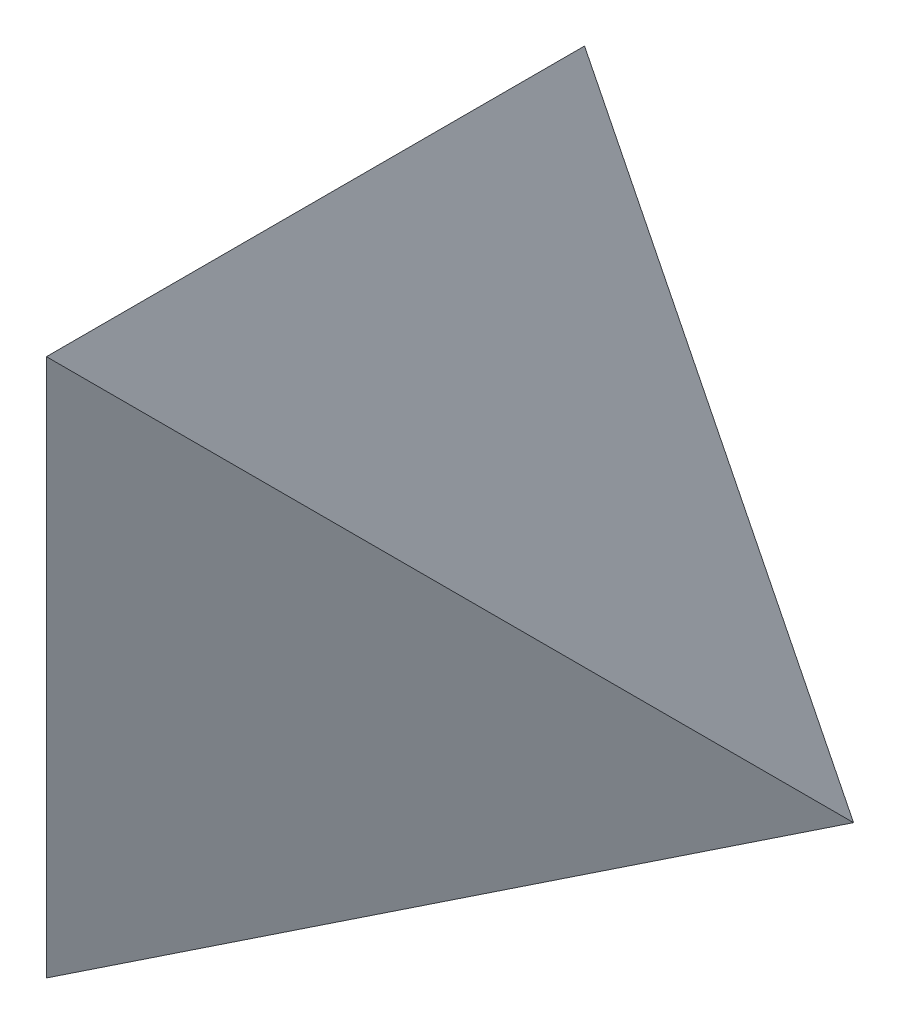
ISO-10303-21;
HEADER;
FILE_DESCRIPTION(('STEP AP214'),'2;1');
FILE_NAME('part.step','',(''),(''),'','','');
FILE_SCHEMA(('AUTOMOTIVE_DESIGN { 1 0 10303 214 1 1 1 1 }'));
ENDSEC;
DATA;
#1=APPLICATION_CONTEXT('core data for automotive mechanical design processes');
#2=APPLICATION_PROTOCOL_DEFINITION('international standard','automotive_design',2000,#1);
#3=PRODUCT_CONTEXT('',#1,'mechanical');
#4=PRODUCT('Part','Part','',(#3));
#5=PRODUCT_RELATED_PRODUCT_CATEGORY('part','',(#4));
#6=PRODUCT_DEFINITION_FORMATION('','',#4);
#7=PRODUCT_DEFINITION_CONTEXT('part definition',#1,'design');
#8=PRODUCT_DEFINITION('design','',#6,#7);
#9=PRODUCT_DEFINITION_SHAPE('','',#8);
#10=(LENGTH_UNIT() NAMED_UNIT(*) SI_UNIT(.MILLI.,.METRE.));
#11=(NAMED_UNIT(*) PLANE_ANGLE_UNIT() SI_UNIT($,.RADIAN.));
#12=(NAMED_UNIT(*) SI_UNIT($,.STERADIAN.) SOLID_ANGLE_UNIT());
#13=UNCERTAINTY_MEASURE_WITH_UNIT(LENGTH_MEASURE(1.E-05),#10,'distance_accuracy_value','');
#14=(GEOMETRIC_REPRESENTATION_CONTEXT(3) GLOBAL_UNCERTAINTY_ASSIGNED_CONTEXT((#13)) GLOBAL_UNIT_ASSIGNED_CONTEXT((#10,
#11,#12)) REPRESENTATION_CONTEXT('',''));
#15=CARTESIAN_POINT('',(0.,0.,0.));
#16=DIRECTION('',(0.,0.,1.));
#17=DIRECTION('',(1.,0.,0.));
#18=AXIS2_PLACEMENT_3D('',#15,#16,#17);
#19=CARTESIAN_POINT('',(0.,0.,0.));
#20=DIRECTION('',(0.,-1.,0.));
#21=DIRECTION('',(0.,0.,-1.));
#22=AXIS2_PLACEMENT_3D('',#19,#20,#21);
#23=PLANE('',#22);
#24=DIRECTION('',(0.447213595499958,0.,-0.894427190999916));
#25=VECTOR('',#24,1.);
#26=CARTESIAN_POINT('',(0.799999999999999,0.,0.4));
#27=LINE('',#26,#25);
#28=CARTESIAN_POINT('',(0.,0.,2.));
#29=VERTEX_POINT('',#28);
#30=CARTESIAN_POINT('',(2.,0.,-2.));
#31=VERTEX_POINT('',#30);
#32=EDGE_CURVE('E72',#29,#31,#27,.T.);
#33=ORIENTED_EDGE('',*,*,#32,.F.);
#34=DIRECTION('',(0.447213595499958,0.,0.894427190999916));
#35=VECTOR('',#34,1.);
#36=CARTESIAN_POINT('',(-2.,0.,-2.));
#37=LINE('',#36,#35);
#38=CARTESIAN_POINT('',(-2.,0.,-2.));
#39=VERTEX_POINT('',#38);
#40=EDGE_CURVE('E42',#39,#29,#37,.T.);
#41=ORIENTED_EDGE('',*,*,#40,.F.);
#42=DIRECTION('',(-1.,0.,0.));
#43=VECTOR('',#42,1.);
#44=CARTESIAN_POINT('',(-2.,0.,-2.));
#45=LINE('',#44,#43);
#46=EDGE_CURVE('E76',#31,#39,#45,.T.);
#47=ORIENTED_EDGE('',*,*,#46,.F.);
#48=EDGE_LOOP('',(#33,#41,#47));
#49=FACE_BOUND('',#48,.T.);
#50=ADVANCED_FACE('F34',(#49),#23,.T.);
#51=CARTESIAN_POINT('',(-2.,4.,-2.));
#52=DIRECTION('',(0.,0.,1.));
#53=DIRECTION('',(1.,0.,0.));
#54=AXIS2_PLACEMENT_3D('',#51,#52,#53);
#55=PLANE('',#54);
#56=DIRECTION('',(-0.447213595499958,-0.894427190999916,0.));
#57=VECTOR('',#56,1.);
#58=CARTESIAN_POINT('',(0.,4.,-2.));
#59=LINE('',#58,#57);
#60=CARTESIAN_POINT('',(0.,4.,-2.));
#61=VERTEX_POINT('',#60);
#62=EDGE_CURVE('E57',#61,#39,#59,.T.);
#63=ORIENTED_EDGE('',*,*,#62,.F.);
#64=DIRECTION('',(0.447213595499958,-0.894427190999916,0.));
#65=VECTOR('',#64,1.);
#66=CARTESIAN_POINT('',(-0.400000000000001,4.8,-2.));
#67=LINE('',#66,#65);
#68=EDGE_CURVE('E49',#61,#31,#67,.T.);
#69=ORIENTED_EDGE('',*,*,#68,.T.);
#70=ORIENTED_EDGE('',*,*,#46,.T.);
#71=EDGE_LOOP('',(#63,#69,#70));
#72=FACE_BOUND('',#71,.T.);
#73=ADVANCED_FACE('F105',(#72),#55,.F.);
#74=CARTESIAN_POINT('',(-0.666666666666668,0.333333333333334,0.333333333333334));
#75=DIRECTION('',(0.816496580927726,-0.408248290463863,-0.408248290463863));
#76=DIRECTION('',(0.447213595499958,0.894427190999916,0.));
#77=AXIS2_PLACEMENT_3D('',#74,#75,#76);
#78=PLANE('',#77);
#79=DIRECTION('',(0.,0.707106781186548,-0.707106781186548));
#80=VECTOR('',#79,1.);
#81=CARTESIAN_POINT('',(0.,0.,2.));
#82=LINE('',#81,#80);
#83=EDGE_CURVE('E82',#29,#61,#82,.T.);
#84=ORIENTED_EDGE('',*,*,#83,.T.);
#85=ORIENTED_EDGE('',*,*,#62,.T.);
#86=ORIENTED_EDGE('',*,*,#40,.T.);
#87=EDGE_LOOP('',(#84,#85,#86));
#88=FACE_BOUND('',#87,.T.);
#89=ADVANCED_FACE('F81',(#88),#78,.F.);
#90=CARTESIAN_POINT('',(0.,0.,2.));
#91=DIRECTION('',(1.,0.,0.));
#92=DIRECTION('',(0.,0.,-1.));
#93=AXIS2_PLACEMENT_3D('',#90,#91,#92);
#94=PLANE('',#93);
#95=ORIENTED_EDGE('',*,*,#83,.F.);
#96=DIRECTION('',(0.,-1.,0.));
#97=VECTOR('',#96,1.);
#98=CARTESIAN_POINT('',(0.,4.,2.));
#99=LINE('',#98,#97);
#100=CARTESIAN_POINT('',(0.,4.00000000000001,2.));
#101=VERTEX_POINT('',#100);
#102=EDGE_CURVE('E69',#101,#29,#99,.T.);
#103=ORIENTED_EDGE('',*,*,#102,.F.);
#104=DIRECTION('',(0.,0.,1.));
#105=VECTOR('',#104,1.);
#106=CARTESIAN_POINT('',(0.,4.,0.));
#107=LINE('',#106,#105);
#108=EDGE_CURVE('E75',#61,#101,#107,.T.);
#109=ORIENTED_EDGE('',*,*,#108,.F.);
#110=EDGE_LOOP('',(#95,#103,#109));
#111=FACE_BOUND('',#110,.T.);
#112=ADVANCED_FACE('F84',(#111),#94,.F.);
#113=CARTESIAN_POINT('',(1.6,0.8,-8.));
#114=DIRECTION('',(-0.894427190999916,-0.447213595499958,0.));
#115=DIRECTION('',(0.447213595499958,-0.894427190999916,0.));
#116=AXIS2_PLACEMENT_3D('',#113,#114,#115);
#117=PLANE('',#116);
#118=ORIENTED_EDGE('',*,*,#108,.T.);
#119=DIRECTION('',(0.333333333333333,-0.666666666666667,-0.666666666666667));
#120=VECTOR('',#119,1.);
#121=CARTESIAN_POINT('',(3.11111111111111,-2.22222222222222,-4.22222222222222));
#122=LINE('',#121,#120);
#123=EDGE_CURVE('E12',#101,#31,#122,.T.);
#124=ORIENTED_EDGE('',*,*,#123,.T.);
#125=ORIENTED_EDGE('',*,*,#68,.F.);
#126=EDGE_LOOP('',(#118,#124,#125));
#127=FACE_BOUND('',#126,.T.);
#128=ADVANCED_FACE('F115',(#127),#117,.F.);
#129=CARTESIAN_POINT('',(0.799999999999999,10.,0.4));
#130=DIRECTION('',(-0.894427190999916,0.,-0.447213595499958));
#131=DIRECTION('',(-0.447213595499958,0.,0.894427190999916));
#132=AXIS2_PLACEMENT_3D('',#129,#130,#131);
#133=PLANE('',#132);
#134=ORIENTED_EDGE('',*,*,#102,.T.);
#135=ORIENTED_EDGE('',*,*,#32,.T.);
#136=ORIENTED_EDGE('',*,*,#123,.F.);
#137=EDGE_LOOP('',(#134,#135,#136));
#138=FACE_BOUND('',#137,.T.);
#139=ADVANCED_FACE('F71',(#138),#133,.F.);
#140=CLOSED_SHELL('',(#50,#73,#89,#112,#128,#139));
#141=MANIFOLD_SOLID_BREP('B2',#140);
#142=ADVANCED_BREP_SHAPE_REPRESENTATION('',(#18,#141),#14);
#143=SHAPE_DEFINITION_REPRESENTATION(#9,#142);
ENDSEC;
END-ISO-10303-21;
